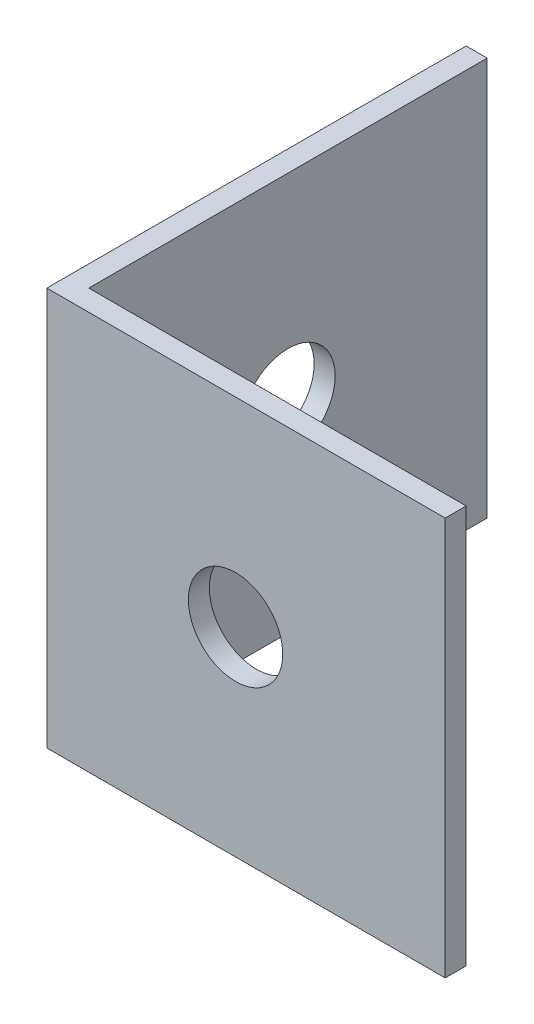
ISO-10303-21;
HEADER;
FILE_DESCRIPTION(('STEP AP214'),'2;1');
FILE_NAME('part.step','',(''),(''),'','','');
FILE_SCHEMA(('AUTOMOTIVE_DESIGN { 1 0 10303 214 1 1 1 1 }'));
ENDSEC;
DATA;
#1=APPLICATION_CONTEXT('core data for automotive mechanical design processes');
#2=APPLICATION_PROTOCOL_DEFINITION('international standard','automotive_design',2000,#1);
#3=PRODUCT_CONTEXT('',#1,'mechanical');
#4=PRODUCT('Part','Part','',(#3));
#5=PRODUCT_RELATED_PRODUCT_CATEGORY('part','',(#4));
#6=PRODUCT_DEFINITION_FORMATION('','',#4);
#7=PRODUCT_DEFINITION_CONTEXT('part definition',#1,'design');
#8=PRODUCT_DEFINITION('design','',#6,#7);
#9=PRODUCT_DEFINITION_SHAPE('','',#8);
#10=(LENGTH_UNIT() NAMED_UNIT(*) SI_UNIT(.MILLI.,.METRE.));
#11=(NAMED_UNIT(*) PLANE_ANGLE_UNIT() SI_UNIT($,.RADIAN.));
#12=(NAMED_UNIT(*) SI_UNIT($,.STERADIAN.) SOLID_ANGLE_UNIT());
#13=UNCERTAINTY_MEASURE_WITH_UNIT(LENGTH_MEASURE(1.E-05),#10,'distance_accuracy_value','');
#14=(GEOMETRIC_REPRESENTATION_CONTEXT(3) GLOBAL_UNCERTAINTY_ASSIGNED_CONTEXT((#13)) GLOBAL_UNIT_ASSIGNED_CONTEXT((#10,
#11,#12)) REPRESENTATION_CONTEXT('',''));
#15=CARTESIAN_POINT('',(0.,0.,0.));
#16=DIRECTION('',(0.,0.,1.));
#17=DIRECTION('',(1.,0.,0.));
#18=AXIS2_PLACEMENT_3D('',#15,#16,#17);
#19=CARTESIAN_POINT('',(20.,19.,0.));
#20=DIRECTION('',(0.,0.,-1.));
#21=DIRECTION('',(-1.,0.,0.));
#22=AXIS2_PLACEMENT_3D('',#19,#20,#21);
#23=PLANE('',#22);
#24=CARTESIAN_POINT('',(9.,9.5,0.));
#25=DIRECTION('',(0.,0.,-1.));
#26=DIRECTION('',(-1.,0.,0.));
#27=AXIS2_PLACEMENT_3D('',#24,#25,#26);
#28=CIRCLE('',#27,2.25);
#29=CARTESIAN_POINT('',(6.75,9.5,0.));
#30=VERTEX_POINT('',#29);
#31=EDGE_CURVE('E148',#30,#30,#28,.T.);
#32=ORIENTED_EDGE('',*,*,#31,.T.);
#33=EDGE_LOOP('',(#32));
#34=FACE_BOUND('',#33,.T.);
#35=DIRECTION('',(0.,-1.,0.));
#36=VECTOR('',#35,1.);
#37=CARTESIAN_POINT('',(19.,19.,0.));
#38=LINE('',#37,#36);
#39=CARTESIAN_POINT('',(19.,19.,0.));
#40=VERTEX_POINT('',#39);
#41=CARTESIAN_POINT('',(19.,0.,0.));
#42=VERTEX_POINT('',#41);
#43=EDGE_CURVE('E48',#40,#42,#38,.T.);
#44=ORIENTED_EDGE('',*,*,#43,.F.);
#45=DIRECTION('',(1.,0.,0.));
#46=VECTOR('',#45,1.);
#47=CARTESIAN_POINT('',(20.,19.,0.));
#48=LINE('',#47,#46);
#49=CARTESIAN_POINT('',(0.,19.,0.));
#50=VERTEX_POINT('',#49);
#51=EDGE_CURVE('E120',#50,#40,#48,.T.);
#52=ORIENTED_EDGE('',*,*,#51,.F.);
#53=DIRECTION('',(0.,-1.,0.));
#54=VECTOR('',#53,1.);
#55=CARTESIAN_POINT('',(0.,19.,0.));
#56=LINE('',#55,#54);
#57=CARTESIAN_POINT('',(0.,0.,0.));
#58=VERTEX_POINT('',#57);
#59=EDGE_CURVE('E121',#50,#58,#56,.T.);
#60=ORIENTED_EDGE('',*,*,#59,.T.);
#61=DIRECTION('',(1.,0.,0.));
#62=VECTOR('',#61,1.);
#63=CARTESIAN_POINT('',(20.,0.,0.));
#64=LINE('',#63,#62);
#65=EDGE_CURVE('E111',#58,#42,#64,.T.);
#66=ORIENTED_EDGE('',*,*,#65,.T.);
#67=EDGE_LOOP('',(#44,#52,#60,#66));
#68=FACE_BOUND('',#67,.T.);
#69=ADVANCED_FACE('F34',(#34,#68),#23,.F.);
#70=CARTESIAN_POINT('',(1.,19.,-0.999999999999997));
#71=DIRECTION('',(0.,0.,1.));
#72=DIRECTION('',(1.,0.,0.));
#73=AXIS2_PLACEMENT_3D('',#70,#71,#72);
#74=PLANE('',#73);
#75=CARTESIAN_POINT('',(9.,9.5,-0.999999999999998));
#76=DIRECTION('',(0.,0.,-1.));
#77=DIRECTION('',(-1.,0.,0.));
#78=AXIS2_PLACEMENT_3D('',#75,#76,#77);
#79=CIRCLE('',#78,2.25);
#80=CARTESIAN_POINT('',(6.75,9.5,-0.999999999999998));
#81=VERTEX_POINT('',#80);
#82=EDGE_CURVE('E151',#81,#81,#79,.T.);
#83=ORIENTED_EDGE('',*,*,#82,.F.);
#84=EDGE_LOOP('',(#83));
#85=FACE_BOUND('',#84,.T.);
#86=DIRECTION('',(0.,1.,0.));
#87=VECTOR('',#86,1.);
#88=CARTESIAN_POINT('',(19.,0.,-0.999999999999998));
#89=LINE('',#88,#87);
#90=CARTESIAN_POINT('',(19.,0.,-0.999999999999998));
#91=VERTEX_POINT('',#90);
#92=CARTESIAN_POINT('',(19.,19.,-0.999999999999998));
#93=VERTEX_POINT('',#92);
#94=EDGE_CURVE('E96',#91,#93,#89,.T.);
#95=ORIENTED_EDGE('',*,*,#94,.F.);
#96=DIRECTION('',(-1.,0.,0.));
#97=VECTOR('',#96,1.);
#98=CARTESIAN_POINT('',(1.,0.,-0.999999999999997));
#99=LINE('',#98,#97);
#100=CARTESIAN_POINT('',(1.,0.,-0.999999999999997));
#101=VERTEX_POINT('',#100);
#102=EDGE_CURVE('E104',#91,#101,#99,.T.);
#103=ORIENTED_EDGE('',*,*,#102,.T.);
#104=DIRECTION('',(0.,-1.,0.));
#105=VECTOR('',#104,1.);
#106=CARTESIAN_POINT('',(1.,19.,-0.999999999999997));
#107=LINE('',#106,#105);
#108=CARTESIAN_POINT('',(1.,19.,-0.999999999999997));
#109=VERTEX_POINT('',#108);
#110=EDGE_CURVE('E11',#109,#101,#107,.T.);
#111=ORIENTED_EDGE('',*,*,#110,.F.);
#112=DIRECTION('',(-1.,0.,0.));
#113=VECTOR('',#112,1.);
#114=CARTESIAN_POINT('',(1.,19.,-0.999999999999997));
#115=LINE('',#114,#113);
#116=EDGE_CURVE('E85',#93,#109,#115,.T.);
#117=ORIENTED_EDGE('',*,*,#116,.F.);
#118=EDGE_LOOP('',(#95,#103,#111,#117));
#119=FACE_BOUND('',#118,.T.);
#120=ADVANCED_FACE('F103',(#85,#119),#74,.F.);
#121=CARTESIAN_POINT('',(0.,19.,0.));
#122=DIRECTION('',(0.,-1.,0.));
#123=DIRECTION('',(0.,0.,-1.));
#124=AXIS2_PLACEMENT_3D('',#121,#122,#123);
#125=PLANE('',#124);
#126=DIRECTION('',(0.,0.,1.));
#127=VECTOR('',#126,1.);
#128=CARTESIAN_POINT('',(19.,19.,-0.999999999999998));
#129=LINE('',#128,#127);
#130=EDGE_CURVE('E105',#93,#40,#129,.T.);
#131=ORIENTED_EDGE('',*,*,#130,.F.);
#132=ORIENTED_EDGE('',*,*,#116,.T.);
#133=DIRECTION('',(0.,0.,-1.));
#134=VECTOR('',#133,1.);
#135=CARTESIAN_POINT('',(0.999999999999998,19.,-20.));
#136=LINE('',#135,#134);
#137=CARTESIAN_POINT('',(0.999999999999998,19.,-20.));
#138=VERTEX_POINT('',#137);
#139=EDGE_CURVE('E136',#109,#138,#136,.T.);
#140=ORIENTED_EDGE('',*,*,#139,.T.);
#141=DIRECTION('',(-1.,0.,0.));
#142=VECTOR('',#141,1.);
#143=CARTESIAN_POINT('',(0.,19.,-20.));
#144=LINE('',#143,#142);
#145=CARTESIAN_POINT('',(0.,19.,-20.));
#146=VERTEX_POINT('',#145);
#147=EDGE_CURVE('E130',#138,#146,#144,.T.);
#148=ORIENTED_EDGE('',*,*,#147,.T.);
#149=DIRECTION('',(0.,0.,1.));
#150=VECTOR('',#149,1.);
#151=CARTESIAN_POINT('',(0.,19.,0.));
#152=LINE('',#151,#150);
#153=EDGE_CURVE('E57',#146,#50,#152,.T.);
#154=ORIENTED_EDGE('',*,*,#153,.T.);
#155=ORIENTED_EDGE('',*,*,#51,.T.);
#156=EDGE_LOOP('',(#131,#132,#140,#148,#154,#155));
#157=FACE_BOUND('',#156,.T.);
#158=ADVANCED_FACE('F166',(#157),#125,.F.);
#159=CARTESIAN_POINT('',(0.,0.,0.));
#160=DIRECTION('',(0.,-1.,0.));
#161=DIRECTION('',(0.,0.,-1.));
#162=AXIS2_PLACEMENT_3D('',#159,#160,#161);
#163=PLANE('',#162);
#164=ORIENTED_EDGE('',*,*,#102,.F.);
#165=DIRECTION('',(0.,0.,-1.));
#166=VECTOR('',#165,1.);
#167=CARTESIAN_POINT('',(19.,0.,0.));
#168=LINE('',#167,#166);
#169=EDGE_CURVE('E93',#42,#91,#168,.T.);
#170=ORIENTED_EDGE('',*,*,#169,.F.);
#171=ORIENTED_EDGE('',*,*,#65,.F.);
#172=DIRECTION('',(0.,0.,1.));
#173=VECTOR('',#172,1.);
#174=CARTESIAN_POINT('',(0.,0.,0.));
#175=LINE('',#174,#173);
#176=CARTESIAN_POINT('',(0.,0.,-20.));
#177=VERTEX_POINT('',#176);
#178=EDGE_CURVE('E78',#177,#58,#175,.T.);
#179=ORIENTED_EDGE('',*,*,#178,.F.);
#180=DIRECTION('',(-1.,0.,0.));
#181=VECTOR('',#180,1.);
#182=CARTESIAN_POINT('',(0.,0.,-20.));
#183=LINE('',#182,#181);
#184=CARTESIAN_POINT('',(0.999999999999998,0.,-20.));
#185=VERTEX_POINT('',#184);
#186=EDGE_CURVE('E113',#185,#177,#183,.T.);
#187=ORIENTED_EDGE('',*,*,#186,.F.);
#188=DIRECTION('',(0.,0.,-1.));
#189=VECTOR('',#188,1.);
#190=CARTESIAN_POINT('',(0.999999999999998,0.,-20.));
#191=LINE('',#190,#189);
#192=EDGE_CURVE('E110',#101,#185,#191,.T.);
#193=ORIENTED_EDGE('',*,*,#192,.F.);
#194=EDGE_LOOP('',(#164,#170,#171,#179,#187,#193));
#195=FACE_BOUND('',#194,.T.);
#196=ADVANCED_FACE('F108',(#195),#163,.T.);
#197=CARTESIAN_POINT('',(0.999999999999998,19.,-20.));
#198=DIRECTION('',(-1.,0.,0.));
#199=DIRECTION('',(0.,0.,1.));
#200=AXIS2_PLACEMENT_3D('',#197,#198,#199);
#201=PLANE('',#200);
#202=CARTESIAN_POINT('',(1.,9.5,-10.5));
#203=DIRECTION('',(1.,0.,0.));
#204=DIRECTION('',(0.,0.,-1.));
#205=AXIS2_PLACEMENT_3D('',#202,#203,#204);
#206=CIRCLE('',#205,2.25);
#207=CARTESIAN_POINT('',(1.,9.5,-12.75));
#208=VERTEX_POINT('',#207);
#209=EDGE_CURVE('E145',#208,#208,#206,.T.);
#210=ORIENTED_EDGE('',*,*,#209,.F.);
#211=EDGE_LOOP('',(#210));
#212=FACE_BOUND('',#211,.T.);
#213=ORIENTED_EDGE('',*,*,#192,.T.);
#214=DIRECTION('',(0.,-1.,0.));
#215=VECTOR('',#214,1.);
#216=CARTESIAN_POINT('',(0.999999999999998,19.,-20.));
#217=LINE('',#216,#215);
#218=EDGE_CURVE('E41',#138,#185,#217,.T.);
#219=ORIENTED_EDGE('',*,*,#218,.F.);
#220=ORIENTED_EDGE('',*,*,#139,.F.);
#221=ORIENTED_EDGE('',*,*,#110,.T.);
#222=EDGE_LOOP('',(#213,#219,#220,#221));
#223=FACE_BOUND('',#222,.T.);
#224=ADVANCED_FACE('F173',(#212,#223),#201,.F.);
#225=CARTESIAN_POINT('',(0.,19.,-20.));
#226=DIRECTION('',(0.,0.,1.));
#227=DIRECTION('',(1.,0.,0.));
#228=AXIS2_PLACEMENT_3D('',#225,#226,#227);
#229=PLANE('',#228);
#230=ORIENTED_EDGE('',*,*,#186,.T.);
#231=DIRECTION('',(0.,-1.,0.));
#232=VECTOR('',#231,1.);
#233=CARTESIAN_POINT('',(0.,19.,-20.));
#234=LINE('',#233,#232);
#235=EDGE_CURVE('E123',#146,#177,#234,.T.);
#236=ORIENTED_EDGE('',*,*,#235,.F.);
#237=ORIENTED_EDGE('',*,*,#147,.F.);
#238=ORIENTED_EDGE('',*,*,#218,.T.);
#239=EDGE_LOOP('',(#230,#236,#237,#238));
#240=FACE_BOUND('',#239,.T.);
#241=ADVANCED_FACE('F128',(#240),#229,.F.);
#242=CARTESIAN_POINT('',(0.,19.,0.));
#243=DIRECTION('',(1.,0.,0.));
#244=DIRECTION('',(0.,0.,-1.));
#245=AXIS2_PLACEMENT_3D('',#242,#243,#244);
#246=PLANE('',#245);
#247=CARTESIAN_POINT('',(0.,9.5,-10.5));
#248=DIRECTION('',(1.,0.,0.));
#249=DIRECTION('',(0.,0.,-1.));
#250=AXIS2_PLACEMENT_3D('',#247,#248,#249);
#251=CIRCLE('',#250,2.25);
#252=CARTESIAN_POINT('',(0.,9.5,-12.75));
#253=VERTEX_POINT('',#252);
#254=EDGE_CURVE('E144',#253,#253,#251,.T.);
#255=ORIENTED_EDGE('',*,*,#254,.T.);
#256=EDGE_LOOP('',(#255));
#257=FACE_BOUND('',#256,.T.);
#258=ORIENTED_EDGE('',*,*,#178,.T.);
#259=ORIENTED_EDGE('',*,*,#59,.F.);
#260=ORIENTED_EDGE('',*,*,#153,.F.);
#261=ORIENTED_EDGE('',*,*,#235,.T.);
#262=EDGE_LOOP('',(#258,#259,#260,#261));
#263=FACE_BOUND('',#262,.T.);
#264=ADVANCED_FACE('F135',(#257,#263),#246,.F.);
#265=CARTESIAN_POINT('',(19.,0.,0.));
#266=DIRECTION('',(1.,0.,0.));
#267=DIRECTION('',(0.,0.,-1.));
#268=AXIS2_PLACEMENT_3D('',#265,#266,#267);
#269=PLANE('',#268);
#270=ORIENTED_EDGE('',*,*,#43,.T.);
#271=ORIENTED_EDGE('',*,*,#169,.T.);
#272=ORIENTED_EDGE('',*,*,#94,.T.);
#273=ORIENTED_EDGE('',*,*,#130,.T.);
#274=EDGE_LOOP('',(#270,#271,#272,#273));
#275=FACE_BOUND('',#274,.T.);
#276=ADVANCED_FACE('F95',(#275),#269,.T.);
#277=CARTESIAN_POINT('',(0.,9.5,-10.5));
#278=DIRECTION('',(1.,0.,0.));
#279=DIRECTION('',(0.,0.,-1.));
#280=AXIS2_PLACEMENT_3D('',#277,#278,#279);
#281=CYLINDRICAL_SURFACE('',#280,2.25);
#282=ORIENTED_EDGE('',*,*,#254,.F.);
#283=EDGE_LOOP('',(#282));
#284=FACE_BOUND('',#283,.T.);
#285=ORIENTED_EDGE('',*,*,#209,.T.);
#286=EDGE_LOOP('',(#285));
#287=FACE_BOUND('',#286,.T.);
#288=ADVANCED_FACE('F161',(#284,#287),#281,.F.);
#289=CARTESIAN_POINT('',(9.,9.5,0.));
#290=DIRECTION('',(0.,0.,-1.));
#291=DIRECTION('',(-1.,0.,0.));
#292=AXIS2_PLACEMENT_3D('',#289,#290,#291);
#293=CYLINDRICAL_SURFACE('',#292,2.25);
#294=ORIENTED_EDGE('',*,*,#31,.F.);
#295=EDGE_LOOP('',(#294));
#296=FACE_BOUND('',#295,.T.);
#297=ORIENTED_EDGE('',*,*,#82,.T.);
#298=EDGE_LOOP('',(#297));
#299=FACE_BOUND('',#298,.T.);
#300=ADVANCED_FACE('F158',(#296,#299),#293,.F.);
#301=CLOSED_SHELL('',(#69,#120,#158,#196,#224,#241,#264,#276,#288,#300));
#302=MANIFOLD_SOLID_BREP('B2',#301);
#303=ADVANCED_BREP_SHAPE_REPRESENTATION('',(#18,#302),#14);
#304=SHAPE_DEFINITION_REPRESENTATION(#9,#303);
ENDSEC;
END-ISO-10303-21;
